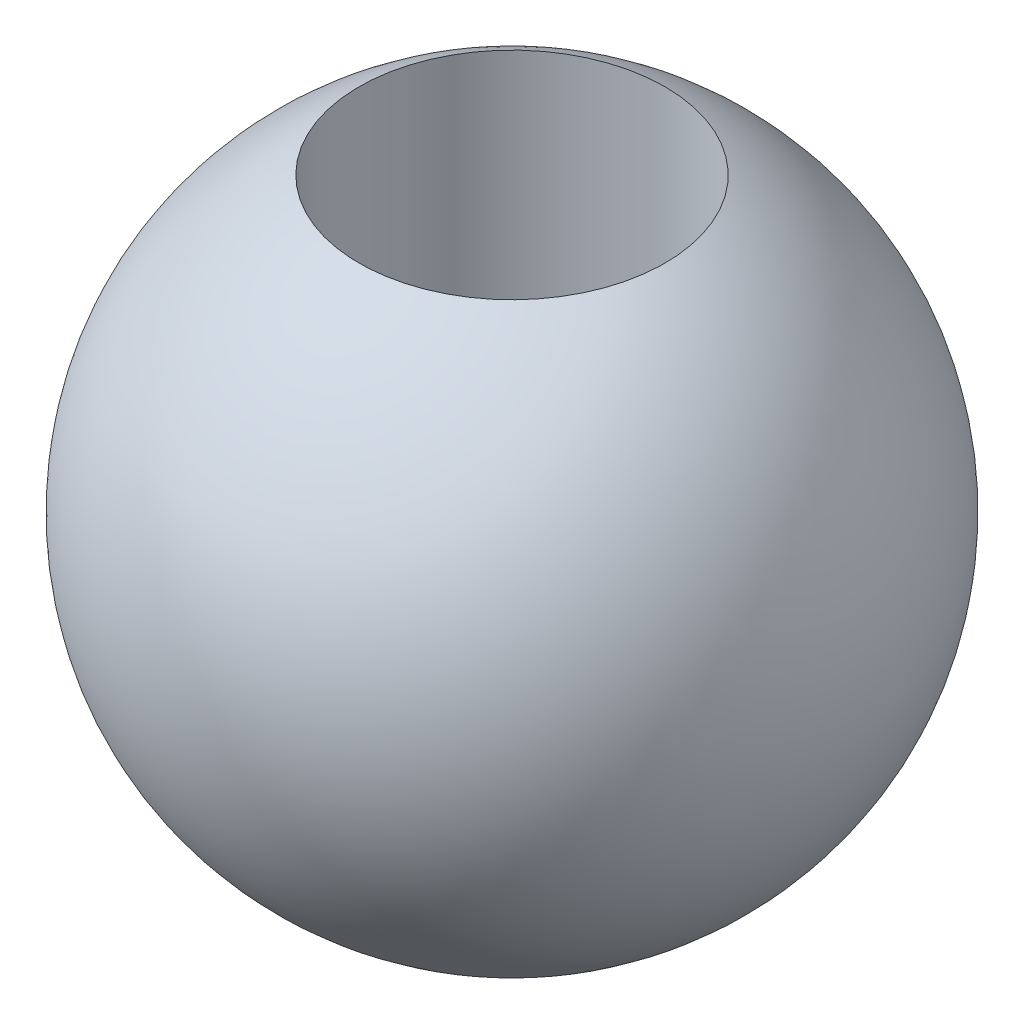
ISO-10303-21;
HEADER;
FILE_DESCRIPTION(('STEP AP214'),'2;1');
FILE_NAME('part.step','',(''),(''),'','','');
FILE_SCHEMA(('AUTOMOTIVE_DESIGN { 1 0 10303 214 1 1 1 1 }'));
ENDSEC;
DATA;
#1=APPLICATION_CONTEXT('core data for automotive mechanical design processes');
#2=APPLICATION_PROTOCOL_DEFINITION('international standard','automotive_design',2000,#1);
#3=PRODUCT_CONTEXT('',#1,'mechanical');
#4=PRODUCT('Part','Part','',(#3));
#5=PRODUCT_RELATED_PRODUCT_CATEGORY('part','',(#4));
#6=PRODUCT_DEFINITION_FORMATION('','',#4);
#7=PRODUCT_DEFINITION_CONTEXT('part definition',#1,'design');
#8=PRODUCT_DEFINITION('design','',#6,#7);
#9=PRODUCT_DEFINITION_SHAPE('','',#8);
#10=(LENGTH_UNIT() NAMED_UNIT(*) SI_UNIT(.MILLI.,.METRE.));
#11=(NAMED_UNIT(*) PLANE_ANGLE_UNIT() SI_UNIT($,.RADIAN.));
#12=(NAMED_UNIT(*) SI_UNIT($,.STERADIAN.) SOLID_ANGLE_UNIT());
#13=UNCERTAINTY_MEASURE_WITH_UNIT(LENGTH_MEASURE(1.E-05),#10,'distance_accuracy_value','');
#14=(GEOMETRIC_REPRESENTATION_CONTEXT(3) GLOBAL_UNCERTAINTY_ASSIGNED_CONTEXT((#13)) GLOBAL_UNIT_ASSIGNED_CONTEXT((#10,
#11,#12)) REPRESENTATION_CONTEXT('',''));
#15=CARTESIAN_POINT('',(0.,0.,0.));
#16=DIRECTION('',(0.,0.,1.));
#17=DIRECTION('',(1.,0.,0.));
#18=AXIS2_PLACEMENT_3D('',#15,#16,#17);
#19=CARTESIAN_POINT('',(0.,0.,0.));
#20=DIRECTION('',(0.,-1.,0.));
#21=DIRECTION('',(0.,0.,1.));
#22=AXIS2_PLACEMENT_3D('',#19,#20,#21);
#23=SPHERICAL_SURFACE('',#22,3.175);
#24=CARTESIAN_POINT('',(0.,-2.812526757206,0.));
#25=DIRECTION('',(0.,-1.,0.));
#26=DIRECTION('',(0.,0.,-1.));
#27=AXIS2_PLACEMENT_3D('',#24,#25,#26);
#28=CIRCLE('',#27,1.47320000000001);
#29=CARTESIAN_POINT('',(0.,-2.812526757206,-1.47320000000002));
#30=VERTEX_POINT('',#29);
#31=EDGE_CURVE('E36',#30,#30,#28,.T.);
#32=ORIENTED_EDGE('',*,*,#31,.F.);
#33=EDGE_LOOP('',(#32));
#34=FACE_BOUND('',#33,.T.);
#35=CARTESIAN_POINT('',(0.,2.81252675720611,0.));
#36=DIRECTION('',(0.,-1.,0.));
#37=DIRECTION('',(0.,0.,-1.));
#38=AXIS2_PLACEMENT_3D('',#35,#36,#37);
#39=CIRCLE('',#38,1.47319999999999);
#40=CARTESIAN_POINT('',(0.,2.81252675720612,-1.47319999999998));
#41=VERTEX_POINT('',#40);
#42=EDGE_CURVE('E10',#41,#41,#39,.T.);
#43=ORIENTED_EDGE('',*,*,#42,.T.);
#44=EDGE_LOOP('',(#43));
#45=FACE_BOUND('',#44,.T.);
#46=ADVANCED_FACE('F30',(#34,#45),#23,.T.);
#47=CARTESIAN_POINT('',(0.,-1000.,-3.49148133884313E-12));
#48=DIRECTION('',(0.,-1.,0.));
#49=DIRECTION('',(0.,0.,-1.));
#50=AXIS2_PLACEMENT_3D('',#47,#48,#49);
#51=CYLINDRICAL_SURFACE('',#50,1.4732);
#52=ORIENTED_EDGE('',*,*,#42,.F.);
#53=EDGE_LOOP('',(#52));
#54=FACE_BOUND('',#53,.T.);
#55=ORIENTED_EDGE('',*,*,#31,.T.);
#56=EDGE_LOOP('',(#55));
#57=FACE_BOUND('',#56,.T.);
#58=ADVANCED_FACE('F42',(#54,#57),#51,.F.);
#59=CLOSED_SHELL('',(#46,#58));
#60=MANIFOLD_SOLID_BREP('B2',#59);
#61=ADVANCED_BREP_SHAPE_REPRESENTATION('',(#18,#60),#14);
#62=SHAPE_DEFINITION_REPRESENTATION(#9,#61);
ENDSEC;
END-ISO-10303-21;
